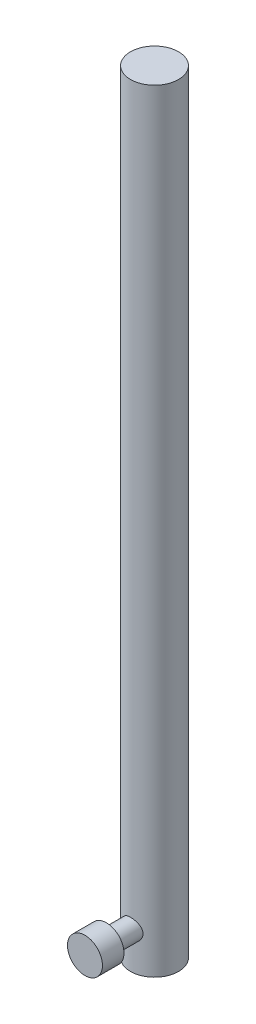
ISO-10303-21;
HEADER;
FILE_DESCRIPTION(('STEP AP214'),'2;1');
FILE_NAME('part.step','',(''),(''),'','','');
FILE_SCHEMA(('AUTOMOTIVE_DESIGN { 1 0 10303 214 1 1 1 1 }'));
ENDSEC;
DATA;
#1=APPLICATION_CONTEXT('core data for automotive mechanical design processes');
#2=APPLICATION_PROTOCOL_DEFINITION('international standard','automotive_design',2000,#1);
#3=PRODUCT_CONTEXT('',#1,'mechanical');
#4=PRODUCT('Part','Part','',(#3));
#5=PRODUCT_RELATED_PRODUCT_CATEGORY('part','',(#4));
#6=PRODUCT_DEFINITION_FORMATION('','',#4);
#7=PRODUCT_DEFINITION_CONTEXT('part definition',#1,'design');
#8=PRODUCT_DEFINITION('design','',#6,#7);
#9=PRODUCT_DEFINITION_SHAPE('','',#8);
#10=(LENGTH_UNIT() NAMED_UNIT(*) SI_UNIT(.MILLI.,.METRE.));
#11=(NAMED_UNIT(*) PLANE_ANGLE_UNIT() SI_UNIT($,.RADIAN.));
#12=(NAMED_UNIT(*) SI_UNIT($,.STERADIAN.) SOLID_ANGLE_UNIT());
#13=UNCERTAINTY_MEASURE_WITH_UNIT(LENGTH_MEASURE(1.E-05),#10,'distance_accuracy_value','');
#14=(GEOMETRIC_REPRESENTATION_CONTEXT(3) GLOBAL_UNCERTAINTY_ASSIGNED_CONTEXT((#13)) GLOBAL_UNIT_ASSIGNED_CONTEXT((#10,
#11,#12)) REPRESENTATION_CONTEXT('',''));
#15=CARTESIAN_POINT('',(0.,0.,0.));
#16=DIRECTION('',(0.,0.,1.));
#17=DIRECTION('',(1.,0.,0.));
#18=AXIS2_PLACEMENT_3D('',#15,#16,#17);
#19=CARTESIAN_POINT('',(0.,102.108,0.));
#20=DIRECTION('',(0.,-1.,0.));
#21=DIRECTION('',(0.,0.,-1.));
#22=AXIS2_PLACEMENT_3D('',#19,#20,#21);
#23=CYLINDRICAL_SURFACE('',#22,3.175);
#24=CARTESIAN_POINT('',(0.,0.,0.));
#25=DIRECTION('',(0.,1.,0.));
#26=DIRECTION('',(0.,0.,1.));
#27=AXIS2_PLACEMENT_3D('',#24,#25,#26);
#28=CIRCLE('',#27,3.175);
#29=CARTESIAN_POINT('',(0.,0.,3.175));
#30=VERTEX_POINT('',#29);
#31=EDGE_CURVE('E129',#30,#30,#28,.T.);
#32=ORIENTED_EDGE('',*,*,#31,.T.);
#33=EDGE_LOOP('',(#32));
#34=FACE_BOUND('',#33,.T.);
#35=CARTESIAN_POINT('',(0.,102.108,0.));
#36=DIRECTION('',(0.,1.,0.));
#37=DIRECTION('',(0.,0.,1.));
#38=AXIS2_PLACEMENT_3D('',#35,#36,#37);
#39=CIRCLE('',#38,3.175);
#40=CARTESIAN_POINT('',(0.,102.108,3.175));
#41=VERTEX_POINT('',#40);
#42=EDGE_CURVE('E68',#41,#41,#39,.T.);
#43=ORIENTED_EDGE('',*,*,#42,.F.);
#44=EDGE_LOOP('',(#43));
#45=FACE_BOUND('',#44,.T.);
#46=CARTESIAN_POINT('',(-1.35382,4.85382,2.87189770145108));
#47=CARTESIAN_POINT('',(-1.35381142228416,4.78178527879643,2.87190615339939));
#48=CARTESIAN_POINT('',(-1.34803428071228,4.70964023374533,2.87464762889286));
#49=CARTESIAN_POINT('',(-1.32515391894357,4.56744275120653,2.88526250822312));
#50=CARTESIAN_POINT('',(-1.30802062166884,4.49739638846042,2.89314953932647));
#51=CARTESIAN_POINT('',(-1.26322683379733,4.36171488687498,2.91298399106182));
#52=CARTESIAN_POINT('',(-1.2356106359559,4.29606253668086,2.9249143054327));
#53=CARTESIAN_POINT('',(-1.17076538079496,4.17034064718567,2.95146676418575));
#54=CARTESIAN_POINT('',(-1.13353828155274,4.11026997408761,2.96608836008562));
#55=CARTESIAN_POINT('',(-1.04793233597021,3.99346307381684,2.99744183012029));
#56=CARTESIAN_POINT('',(-0.999023918536112,3.93713454775226,3.01424738115443));
#57=CARTESIAN_POINT('',(-0.892554561058333,3.83317604635798,3.04747109252372));
#58=CARTESIAN_POINT('',(-0.834990208168869,3.78554951851573,3.06388909709044));
#59=CARTESIAN_POINT('',(-0.709607104496236,3.69823238165623,3.09539064187731));
#60=CARTESIAN_POINT('',(-0.641439437997789,3.65900517456155,3.11037861682877));
#61=CARTESIAN_POINT('',(-0.498717487402645,3.59275279200618,3.13642394106909));
#62=CARTESIAN_POINT('',(-0.424166184700303,3.56572195697194,3.14748311296206));
#63=CARTESIAN_POINT('',(-0.275078251523646,3.52612178625564,3.16390141625311));
#64=CARTESIAN_POINT('',(-0.200759771238017,3.51284812918421,3.16953696879562));
#65=CARTESIAN_POINT('',(-0.0507511927751991,3.49885852418454,3.17548015037632));
#66=CARTESIAN_POINT('',(0.0249383073634244,3.49813722696234,3.17579004898611));
#67=CARTESIAN_POINT('',(0.170400950739695,3.50891408338624,3.1712064249578));
#68=CARTESIAN_POINT('',(0.2402439156591,3.51963702663295,3.16664299981304));
#69=CARTESIAN_POINT('',(0.377028469796356,3.55166286405115,3.15328380378995));
#70=CARTESIAN_POINT('',(0.443969844286547,3.57296653978473,3.14448772026129));
#71=CARTESIAN_POINT('',(0.574286941395332,3.62579548386549,3.12333919617656));
#72=CARTESIAN_POINT('',(0.63759243955905,3.65747215504802,3.11093440262354));
#73=CARTESIAN_POINT('',(0.758155801903625,3.72999517484343,3.08377195448261));
#74=CARTESIAN_POINT('',(0.815411488341505,3.77084480901143,3.06901345739971));
#75=CARTESIAN_POINT('',(0.926713191008751,3.86403320631901,3.0373372090291));
#76=CARTESIAN_POINT('',(0.980216009783288,3.9169947842494,3.02034048031172));
#77=CARTESIAN_POINT('',(1.07782230972426,4.031158743125,2.98690333718196));
#78=CARTESIAN_POINT('',(1.1219218143327,4.09236459269964,2.97046316059186));
#79=CARTESIAN_POINT('',(1.20095869075221,4.22403583440652,2.93942082594528));
#80=CARTESIAN_POINT('',(1.23551166605267,4.29475422380019,2.92490550812828));
#81=CARTESIAN_POINT('',(1.29199390363088,4.44178846862235,2.9004026893379));
#82=CARTESIAN_POINT('',(1.31393268755954,4.51810005291392,2.89041177439368));
#83=CARTESIAN_POINT('',(1.34314669310234,4.66870236542284,2.87694724510349));
#84=CARTESIAN_POINT('',(1.35130594809818,4.74278588776625,2.87308179525616));
#85=CARTESIAN_POINT('',(1.35533612289285,4.89134851490668,2.87118392780632));
#86=CARTESIAN_POINT('',(1.35121164013541,4.96582746129246,2.87314932788618));
#87=CARTESIAN_POINT('',(1.33159911809945,5.10768898727275,2.88228534916434));
#88=CARTESIAN_POINT('',(1.31690812072575,5.17520838009434,2.88909051862509));
#89=CARTESIAN_POINT('',(1.27764920814589,5.30676141917168,2.90666415792056));
#90=CARTESIAN_POINT('',(1.25307891063266,5.37079422043455,2.91743358364812));
#91=CARTESIAN_POINT('',(1.19358377177312,5.49665823674378,2.94228852401562));
#92=CARTESIAN_POINT('',(1.15825678149054,5.55827419688496,2.95649739435406));
#93=CARTESIAN_POINT('',(1.07864482145473,5.67500848478275,2.98646240838629));
#94=CARTESIAN_POINT('',(1.03435584882254,5.73012389158669,3.00221924185569));
#95=CARTESIAN_POINT('',(0.933590517029275,5.83723056392191,3.03513989572716));
#96=CARTESIAN_POINT('',(0.876393490796542,5.88854520777457,3.05230814720174));
#97=CARTESIAN_POINT('',(0.753811575931214,5.98097957405124,3.08486803080184));
#98=CARTESIAN_POINT('',(0.688425910298954,6.02209832790776,3.10025949406562));
#99=CARTESIAN_POINT('',(0.550705508113694,6.09300252967605,3.12766579184468));
#100=CARTESIAN_POINT('',(0.478341075112678,6.12273660537439,3.139665258107));
#101=CARTESIAN_POINT('',(0.328991305032905,6.16938183504049,3.15880395652874));
#102=CARTESIAN_POINT('',(0.252008895355335,6.18630102175683,3.16594623303003));
#103=CARTESIAN_POINT('',(0.101640912080045,6.2057901962641,3.17420070128252));
#104=CARTESIAN_POINT('',(0.0283999974199206,6.20931281136644,3.17571305397883));
#105=CARTESIAN_POINT('',(-0.117609949959003,6.20449716758914,3.17366026831081));
#106=CARTESIAN_POINT('',(-0.190379069841523,6.19616116615871,3.17009609633196));
#107=CARTESIAN_POINT('',(-0.330487253617228,6.16854867177737,3.15850605798547));
#108=CARTESIAN_POINT('',(-0.397927521000378,6.14970517265205,3.15065701630327));
#109=CARTESIAN_POINT('',(-0.528655413847157,6.10209646440815,3.13137641775701));
#110=CARTESIAN_POINT('',(-0.591942267767414,6.07332941805322,3.11994419754243));
#111=CARTESIAN_POINT('',(-0.715748776417546,6.00523203041639,3.09394768115489));
#112=CARTESIAN_POINT('',(-0.77601096265985,5.96548011010551,3.07926441038834));
#113=CARTESIAN_POINT('',(-0.889270116409888,5.87714309838841,3.04848712934404));
#114=CARTESIAN_POINT('',(-0.942264225815633,5.82855454943299,3.03239256814504));
#115=CARTESIAN_POINT('',(-1.04344612161364,5.71981767926984,2.99914688637426));
#116=CARTESIAN_POINT('',(-1.09101571869312,5.65908988970699,2.98200286585594));
#117=CARTESIAN_POINT('',(-1.17539449072067,5.53000180718138,2.94976624578277));
#118=CARTESIAN_POINT('',(-1.21219745446673,5.46163713985127,2.9346748330396));
#119=CARTESIAN_POINT('',(-1.27370318114949,5.31913492481194,2.90850906005651));
#120=CARTESIAN_POINT('',(-1.2984360009552,5.2450122552546,2.89742473947121));
#121=CARTESIAN_POINT('',(-1.33476329449195,5.09316408041629,2.88087616561345));
#122=CARTESIAN_POINT('',(-1.34640183721237,5.01545158179109,2.87539306711189));
#123=CARTESIAN_POINT('',(-1.35296286010547,4.90955275058417,2.87230040022709));
#124=CARTESIAN_POINT('',(-1.35382331924238,4.88169463517761,2.87189443087584));
#125=CARTESIAN_POINT('',(-1.35382,4.85382,2.87189770145108));
#126=B_SPLINE_CURVE_WITH_KNOTS('',3,(#46,#47,#48,#49,#50,#51,#52,#53,#54,#55,#56,#57,#58,#59,
#60,#61,#62,#63,#64,#65,#66,#67,#68,#69,#70,#71,#72,#73,#74,#75,#76,#77,#78,#79,#80,#81,#82,#83,
#84,#85,#86,#87,#88,#89,#90,#91,#92,#93,#94,#95,#96,#97,#98,#99,#100,#101,#102,#103,#104,#105,
#106,#107,#108,#109,#110,#111,#112,#113,#114,#115,#116,#117,#118,#119,#120,#121,#122,#123,#124,
#125),.UNSPECIFIED.,.T.,.F.,(4,2,2,2,2,2,2,2,2,2,2,2,2,2,2,2,2,2,2,2,2,2,2,2,2,2,2,2,2,2,2,2,2,
2,2,2,2,2,2,4),(0.,0.216021326841516,0.432617090361898,0.648307692110528,0.863954384758075,
1.09236273355408,1.3208613760451,1.5598258793317,1.79867937980498,2.02458878143529,
2.25040190751089,2.4618352401061,2.67328419287318,2.88796830237239,3.10272943003436,
3.33323810249158,3.56384406204454,3.80270332763691,4.04138205605385,4.26406813073999,
4.48667087101723,4.69403866331436,4.90145649056434,5.11785207578275,5.33434452851275,
5.56946069032969,5.80459917866288,6.04078654042894,6.27682573021964,6.49572743397313,
6.71458747238102,6.92503219186545,7.13551589381974,7.35558996104085,7.57575032366364,
7.81171639106655,8.04781831855567,8.28332927029353,8.51804521290998,8.60163706383523),.UNSPECIFIED.);
#127=CARTESIAN_POINT('',(-1.35382,4.85382,2.87189770145108));
#128=VERTEX_POINT('',#127);
#129=EDGE_CURVE('E11',#128,#128,#126,.T.);
#130=ORIENTED_EDGE('',*,*,#129,.F.);
#131=EDGE_LOOP('',(#130));
#132=FACE_BOUND('',#131,.T.);
#133=ADVANCED_FACE('F31',(#34,#45,#132),#23,.T.);
#134=CARTESIAN_POINT('',(0.,6.35,0.));
#135=DIRECTION('',(0.,-1.,0.));
#136=DIRECTION('',(0.,0.,-1.));
#137=AXIS2_PLACEMENT_3D('',#134,#135,#136);
#138=CYLINDRICAL_SURFACE('',#137,1.);
#139=CARTESIAN_POINT('',(0.,0.,0.));
#140=DIRECTION('',(0.,-1.,0.));
#141=DIRECTION('',(0.,0.,-1.));
#142=AXIS2_PLACEMENT_3D('',#139,#140,#141);
#143=CIRCLE('',#142,1.);
#144=CARTESIAN_POINT('',(0.,0.,-1.));
#145=VERTEX_POINT('',#144);
#146=EDGE_CURVE('E137',#145,#145,#143,.T.);
#147=ORIENTED_EDGE('',*,*,#146,.T.);
#148=EDGE_LOOP('',(#147));
#149=FACE_BOUND('',#148,.T.);
#150=CARTESIAN_POINT('',(0.,6.35,0.));
#151=DIRECTION('',(0.,-1.,0.));
#152=DIRECTION('',(0.,0.,-1.));
#153=AXIS2_PLACEMENT_3D('',#150,#151,#152);
#154=CIRCLE('',#153,1.);
#155=CARTESIAN_POINT('',(0.,6.35,-1.));
#156=VERTEX_POINT('',#155);
#157=EDGE_CURVE('E83',#156,#156,#154,.T.);
#158=ORIENTED_EDGE('',*,*,#157,.F.);
#159=EDGE_LOOP('',(#158));
#160=FACE_BOUND('',#159,.T.);
#161=DIRECTION('',(0.,-1.,0.));
#162=VECTOR('',#161,1.);
#163=CARTESIAN_POINT('',(-1.,6.35,0.));
#164=LINE('',#163,#162);
#165=CARTESIAN_POINT('',(-1.,3.94122557069419,0.));
#166=VERTEX_POINT('',#165);
#167=CARTESIAN_POINT('',(-1.,5.76641442930581,0.));
#168=VERTEX_POINT('',#167);
#169=EDGE_CURVE('E35',#166,#168,#164,.F.);
#170=ORIENTED_EDGE('',*,*,#169,.F.);
#171=CARTESIAN_POINT('',(1.,3.94122557069419,0.));
#172=CARTESIAN_POINT('',(1.00000511214021,3.94124004161845,0.0237213055983392));
#173=CARTESIAN_POINT('',(0.999155544112792,3.94029979878123,0.0474219644977218));
#174=CARTESIAN_POINT('',(0.995801046742013,3.93664018336344,0.0945224296701222));
#175=CARTESIAN_POINT('',(0.993299350301345,3.93392428550732,0.11792273269981));
#176=CARTESIAN_POINT('',(0.983478507098933,3.92339506460693,0.186815033275608));
#177=CARTESIAN_POINT('',(0.97384044649221,3.9131932985857,0.231632112740939));
#178=CARTESIAN_POINT('',(0.949167837633535,3.88831092168676,0.317948719260517));
#179=CARTESIAN_POINT('',(0.934172273042721,3.87366277758343,0.359469630201528));
#180=CARTESIAN_POINT('',(0.899334617524785,3.84160003231702,0.439437435692129));
#181=CARTESIAN_POINT('',(0.879475196479821,3.82417561852924,0.477872670872861));
#182=CARTESIAN_POINT('',(0.830915391435768,3.78443839429363,0.558774739094301));
#183=CARTESIAN_POINT('',(0.801241820805782,3.76184345188414,0.600518297634789));
#184=CARTESIAN_POINT('',(0.735859334824777,3.71675316330911,0.679059772196196));
#185=CARTESIAN_POINT('',(0.700147042978353,3.6942578801283,0.715854900569169));
#186=CARTESIAN_POINT('',(0.615320947234365,3.64675307689138,0.79067935793775));
#187=CARTESIAN_POINT('',(0.564952084223723,3.62211184099887,0.827543565943061));
#188=CARTESIAN_POINT('',(0.456558146943862,3.57797331339796,0.891908946825326));
#189=CARTESIAN_POINT('',(0.398549553943174,3.55846521208489,0.919429831406381));
#190=CARTESIAN_POINT('',(0.294499575836977,3.53166937046956,0.956747831357076));
#191=CARTESIAN_POINT('',(0.249956651014413,3.52247495220736,0.969377133338135));
#192=CARTESIAN_POINT('',(0.158885436424527,3.50856972371849,0.988388980714752));
#193=CARTESIAN_POINT('',(0.11235891586727,3.50385500189411,0.994776976055435));
#194=CARTESIAN_POINT('',(0.0185126254039587,3.49930962881772,1.00093659392903));
#195=CARTESIAN_POINT('',(-0.0288088061188651,3.49949094954801,1.00069199820154));
#196=CARTESIAN_POINT('',(-0.122675065690299,3.50474989258142,0.993562909534897));
#197=CARTESIAN_POINT('',(-0.169219700282237,3.50982871660004,0.986676786943711));
#198=CARTESIAN_POINT('',(-0.258756708563003,3.52420838049952,0.966996213147564));
#199=CARTESIAN_POINT('',(-0.301814842541836,3.53337083376167,0.954395200872019));
#200=CARTESIAN_POINT('',(-0.385072130278742,3.55520432221905,0.923951489045881));
#201=CARTESIAN_POINT('',(-0.42527065794476,3.56787612280944,0.90610764597239));
#202=CARTESIAN_POINT('',(-0.506463068288252,3.59748010295669,0.863608469622721));
#203=CARTESIAN_POINT('',(-0.547061675800682,3.61472692567156,0.83842109399366));
#204=CARTESIAN_POINT('',(-0.623648454876973,3.65144790651269,0.783133035715469));
#205=CARTESIAN_POINT('',(-0.659632681623747,3.67092394382275,0.753028198477479));
#206=CARTESIAN_POINT('',(-0.733249924405706,3.71480986026456,0.68222780387262));
#207=CARTESIAN_POINT('',(-0.769861263060921,3.73944660983649,0.640609572035453));
#208=CARTESIAN_POINT('',(-0.835928617723872,3.78811237709663,0.551631537112706));
#209=CARTESIAN_POINT('',(-0.865379131910895,3.8121409148636,0.5042673609059));
#210=CARTESIAN_POINT('',(-0.911177345004969,3.85216614016381,0.414418611679372));
#211=CARTESIAN_POINT('',(-0.928975703326979,3.86879517714467,0.372958409433787));
#212=CARTESIAN_POINT('',(-0.959042074630633,3.89804518301748,0.286881700122387));
#213=CARTESIAN_POINT('',(-0.971335707375562,3.91068463707776,0.242280956972089));
#214=CARTESIAN_POINT('',(-0.986880187527612,3.92700445754668,0.164659726315203));
#215=CARTESIAN_POINT('',(-0.991749102039944,3.93224448433547,0.132293991600466));
#216=CARTESIAN_POINT('',(-0.998332121520634,3.93939691475009,0.066645608345321));
#217=CARTESIAN_POINT('',(-1.00002261102266,3.9412844035869,0.0333579465486954));
#218=CARTESIAN_POINT('',(-1.,3.94122557069419,0.));
#219=B_SPLINE_CURVE_WITH_KNOTS('',3,(#171,#172,#173,#174,#175,#176,#177,#178,#179,#180,#181,
#182,#183,#184,#185,#186,#187,#188,#189,#190,#191,#192,#193,#194,#195,#196,#197,#198,#199,#200,
#201,#202,#203,#204,#205,#206,#207,#208,#209,#210,#211,#212,#213,#214,#215,#216,#217,#218),
.UNSPECIFIED.,.F.,.F.,(4,2,2,2,2,2,2,2,2,2,2,2,2,2,2,2,2,2,2,2,2,2,2,4),(0.,0.0710935143434935,
0.142048322712988,0.28209173184269,0.421136207963379,0.5606835027299,0.728043878437994,
0.895498143481713,1.09569084033054,1.29545852520792,1.43646935924249,1.5773569514598,
1.71858907829649,1.85985586851672,1.99666175623454,2.13349750509996,2.28532319414256,
2.43727782516194,2.61855370668411,2.7999684294849,2.94376951277038,3.0868941864878,
3.18602245425892,3.28588437117136),.UNSPECIFIED.);
#220=CARTESIAN_POINT('',(1.,3.94122557069419,0.));
#221=VERTEX_POINT('',#220);
#222=EDGE_CURVE('E55',#221,#166,#219,.T.);
#223=ORIENTED_EDGE('',*,*,#222,.F.);
#224=DIRECTION('',(0.,-1.,0.));
#225=VECTOR('',#224,1.);
#226=CARTESIAN_POINT('',(1.,6.35,0.));
#227=LINE('',#226,#225);
#228=CARTESIAN_POINT('',(1.,5.76641442930581,0.));
#229=VERTEX_POINT('',#228);
#230=EDGE_CURVE('E58',#229,#221,#227,.T.);
#231=ORIENTED_EDGE('',*,*,#230,.F.);
#232=CARTESIAN_POINT('',(-1.,5.76641442930581,0.));
#233=CARTESIAN_POINT('',(-1.00000511214021,5.76639995838155,0.0237213055983392));
#234=CARTESIAN_POINT('',(-0.999155544112792,5.76734020121877,0.0474219644977219));
#235=CARTESIAN_POINT('',(-0.995801046742013,5.77099981663656,0.0945224296701222));
#236=CARTESIAN_POINT('',(-0.993299350301345,5.77371571449268,0.11792273269981));
#237=CARTESIAN_POINT('',(-0.983478507098933,5.78424493539307,0.186815033275608));
#238=CARTESIAN_POINT('',(-0.97384044649221,5.7944467014143,0.231632112740939));
#239=CARTESIAN_POINT('',(-0.949167837633535,5.81932907831324,0.317948719260517));
#240=CARTESIAN_POINT('',(-0.934172273042721,5.83397722241657,0.359469630201528));
#241=CARTESIAN_POINT('',(-0.899334617524785,5.86603996768298,0.439437435692129));
#242=CARTESIAN_POINT('',(-0.879475196479822,5.88346438147076,0.477872670872861));
#243=CARTESIAN_POINT('',(-0.830915391435768,5.92320160570637,0.558774739094301));
#244=CARTESIAN_POINT('',(-0.801241820805782,5.94579654811586,0.600518297634788));
#245=CARTESIAN_POINT('',(-0.735859334824777,5.99088683669089,0.679059772196195));
#246=CARTESIAN_POINT('',(-0.700147042978353,6.0133821198717,0.715854900569169));
#247=CARTESIAN_POINT('',(-0.615320947234365,6.06088692310862,0.79067935793775));
#248=CARTESIAN_POINT('',(-0.564952084223722,6.08552815900113,0.827543565943061));
#249=CARTESIAN_POINT('',(-0.456558146943862,6.12966668660204,0.891908946825326));
#250=CARTESIAN_POINT('',(-0.398549553943174,6.14917478791511,0.919429831406381));
#251=CARTESIAN_POINT('',(-0.294499575836978,6.17597062953044,0.956747831357076));
#252=CARTESIAN_POINT('',(-0.249956651014414,6.18516504779264,0.969377133338135));
#253=CARTESIAN_POINT('',(-0.158885436424527,6.19907027628151,0.988388980714752));
#254=CARTESIAN_POINT('',(-0.11235891586727,6.20378499810589,0.994776976055435));
#255=CARTESIAN_POINT('',(-0.0185126254039593,6.20833037118228,1.00093659392903));
#256=CARTESIAN_POINT('',(0.0288088061188645,6.20814905045199,1.00069199820154));
#257=CARTESIAN_POINT('',(0.122675065690298,6.20289010741858,0.993562909534897));
#258=CARTESIAN_POINT('',(0.169219700282236,6.19781128339996,0.986676786943711));
#259=CARTESIAN_POINT('',(0.258756708563002,6.18343161950048,0.966996213147564));
#260=CARTESIAN_POINT('',(0.301814842541836,6.17426916623833,0.95439520087202));
#261=CARTESIAN_POINT('',(0.385072130278742,6.15243567778095,0.923951489045882));
#262=CARTESIAN_POINT('',(0.42527065794476,6.13976387719056,0.90610764597239));
#263=CARTESIAN_POINT('',(0.506463068288252,6.11015989704331,0.863608469622722));
#264=CARTESIAN_POINT('',(0.547061675800682,6.09291307432844,0.838421093993661));
#265=CARTESIAN_POINT('',(0.623648454876972,6.05619209348732,0.783133035715469));
#266=CARTESIAN_POINT('',(0.659632681623747,6.03671605617725,0.753028198477479));
#267=CARTESIAN_POINT('',(0.733249924405706,5.99283013973544,0.68222780387262));
#268=CARTESIAN_POINT('',(0.76986126306092,5.96819339016351,0.640609572035454));
#269=CARTESIAN_POINT('',(0.835928617723871,5.91952762290337,0.551631537112707));
#270=CARTESIAN_POINT('',(0.865379131910894,5.8954990851364,0.5042673609059));
#271=CARTESIAN_POINT('',(0.911177345004969,5.85547385983619,0.414418611679373));
#272=CARTESIAN_POINT('',(0.928975703326979,5.83884482285533,0.372958409433788));
#273=CARTESIAN_POINT('',(0.959042074630632,5.80959481698252,0.286881700122388));
#274=CARTESIAN_POINT('',(0.971335707375562,5.79695536292225,0.24228095697209));
#275=CARTESIAN_POINT('',(0.986880187527612,5.78063554245332,0.164659726315204));
#276=CARTESIAN_POINT('',(0.991749102039944,5.77539551566453,0.132293991600467));
#277=CARTESIAN_POINT('',(0.998332121520634,5.76824308524991,0.0666456083453217));
#278=CARTESIAN_POINT('',(1.00002261102266,5.7663555964131,0.0333579465486958));
#279=CARTESIAN_POINT('',(1.,5.76641442930581,0.));
#280=B_SPLINE_CURVE_WITH_KNOTS('',3,(#232,#233,#234,#235,#236,#237,#238,#239,#240,#241,#242,
#243,#244,#245,#246,#247,#248,#249,#250,#251,#252,#253,#254,#255,#256,#257,#258,#259,#260,#261,
#262,#263,#264,#265,#266,#267,#268,#269,#270,#271,#272,#273,#274,#275,#276,#277,#278,#279),
.UNSPECIFIED.,.F.,.F.,(4,2,2,2,2,2,2,2,2,2,2,2,2,2,2,2,2,2,2,2,2,2,2,4),(0.,0.0710935143434936,
0.142048322712988,0.28209173184269,0.421136207963378,0.560683502729899,0.728043878437994,
0.895498143481714,1.09569084033054,1.29545852520792,1.43646935924249,1.5773569514598,
1.71858907829649,1.85985586851672,1.99666175623454,2.13349750509996,2.28532319414256,
2.43727782516194,2.61855370668411,2.7999684294849,2.94376951277038,3.08689418648779,
3.18602245425892,3.28588437117136),.UNSPECIFIED.);
#281=EDGE_CURVE('E51',#168,#229,#280,.T.);
#282=ORIENTED_EDGE('',*,*,#281,.F.);
#283=EDGE_LOOP('',(#170,#223,#231,#282));
#284=FACE_BOUND('',#283,.T.);
#285=ADVANCED_FACE('F57',(#149,#160,#284),#138,.F.);
#286=CARTESIAN_POINT('',(0.,102.108,0.));
#287=DIRECTION('',(0.,1.,0.));
#288=DIRECTION('',(0.,0.,1.));
#289=AXIS2_PLACEMENT_3D('',#286,#287,#288);
#290=PLANE('',#289);
#291=ORIENTED_EDGE('',*,*,#42,.T.);
#292=EDGE_LOOP('',(#291));
#293=FACE_BOUND('',#292,.T.);
#294=ADVANCED_FACE('F108',(#293),#290,.T.);
#295=CARTESIAN_POINT('',(0.,0.,0.));
#296=DIRECTION('',(0.,1.,0.));
#297=DIRECTION('',(0.,0.,1.));
#298=AXIS2_PLACEMENT_3D('',#295,#296,#297);
#299=PLANE('',#298);
#300=ORIENTED_EDGE('',*,*,#146,.F.);
#301=EDGE_LOOP('',(#300));
#302=FACE_BOUND('',#301,.T.);
#303=ORIENTED_EDGE('',*,*,#31,.F.);
#304=EDGE_LOOP('',(#303));
#305=FACE_BOUND('',#304,.T.);
#306=ADVANCED_FACE('F112',(#302,#305),#299,.F.);
#307=CARTESIAN_POINT('',(0.,6.35,0.));
#308=DIRECTION('',(0.,-1.,0.));
#309=DIRECTION('',(0.,0.,-1.));
#310=AXIS2_PLACEMENT_3D('',#307,#308,#309);
#311=PLANE('',#310);
#312=ORIENTED_EDGE('',*,*,#157,.T.);
#313=EDGE_LOOP('',(#312));
#314=FACE_BOUND('',#313,.T.);
#315=ADVANCED_FACE('F94',(#314),#311,.T.);
#316=CARTESIAN_POINT('',(0.,4.85382,0.));
#317=DIRECTION('',(0.,0.,1.));
#318=DIRECTION('',(1.,0.,0.));
#319=AXIS2_PLACEMENT_3D('',#316,#317,#318);
#320=PLANE('',#319);
#321=CARTESIAN_POINT('',(0.,4.85382,0.));
#322=DIRECTION('',(0.,0.,1.));
#323=DIRECTION('',(1.,0.,0.));
#324=AXIS2_PLACEMENT_3D('',#321,#322,#323);
#325=CIRCLE('',#324,1.35382);
#326=EDGE_CURVE('E65',#166,#221,#325,.T.);
#327=ORIENTED_EDGE('',*,*,#326,.F.);
#328=ORIENTED_EDGE('',*,*,#169,.T.);
#329=EDGE_CURVE('E67',#229,#168,#325,.T.);
#330=ORIENTED_EDGE('',*,*,#329,.F.);
#331=ORIENTED_EDGE('',*,*,#230,.T.);
#332=EDGE_LOOP('',(#327,#328,#330,#331));
#333=FACE_BOUND('',#332,.T.);
#334=ADVANCED_FACE('F64',(#333),#320,.F.);
#335=CARTESIAN_POINT('',(0.,4.85382,6.35));
#336=DIRECTION('',(0.,0.,-1.));
#337=DIRECTION('',(-1.,0.,0.));
#338=AXIS2_PLACEMENT_3D('',#335,#336,#337);
#339=CYLINDRICAL_SURFACE('',#338,1.35382);
#340=ORIENTED_EDGE('',*,*,#329,.T.);
#341=ORIENTED_EDGE('',*,*,#281,.T.);
#342=EDGE_LOOP('',(#340,#341));
#343=FACE_BOUND('',#342,.T.);
#344=ADVANCED_FACE('F92',(#343),#339,.T.);
#345=ORIENTED_EDGE('',*,*,#326,.T.);
#346=ORIENTED_EDGE('',*,*,#222,.T.);
#347=EDGE_LOOP('',(#345,#346));
#348=FACE_BOUND('',#347,.T.);
#349=ADVANCED_FACE('F70',(#348),#339,.T.);
#350=CARTESIAN_POINT('',(0.,4.85382,6.35));
#351=DIRECTION('',(0.,0.,1.));
#352=DIRECTION('',(1.,0.,0.));
#353=AXIS2_PLACEMENT_3D('',#350,#351,#352);
#354=CIRCLE('',#353,1.35382);
#355=CARTESIAN_POINT('',(1.35382,4.85382,6.35));
#356=VERTEX_POINT('',#355);
#357=EDGE_CURVE('E73',#356,#356,#354,.T.);
#358=ORIENTED_EDGE('',*,*,#357,.F.);
#359=EDGE_LOOP('',(#358));
#360=FACE_BOUND('',#359,.T.);
#361=ORIENTED_EDGE('',*,*,#129,.T.);
#362=EDGE_LOOP('',(#361));
#363=FACE_BOUND('',#362,.T.);
#364=ADVANCED_FACE('F85',(#360,#363),#339,.T.);
#365=CARTESIAN_POINT('',(0.,4.85382,6.35));
#366=DIRECTION('',(0.,0.,1.));
#367=DIRECTION('',(1.,0.,0.));
#368=AXIS2_PLACEMENT_3D('',#365,#366,#367);
#369=PLANE('',#368);
#370=CARTESIAN_POINT('',(0.,4.85382,6.35));
#371=DIRECTION('',(0.,0.,1.));
#372=DIRECTION('',(1.,0.,0.));
#373=AXIS2_PLACEMENT_3D('',#370,#371,#372);
#374=CIRCLE('',#373,2.3114);
#375=CARTESIAN_POINT('',(2.3114,4.85382,6.35));
#376=VERTEX_POINT('',#375);
#377=EDGE_CURVE('E75',#376,#376,#374,.T.);
#378=ORIENTED_EDGE('',*,*,#377,.F.);
#379=EDGE_LOOP('',(#378));
#380=FACE_BOUND('',#379,.T.);
#381=ORIENTED_EDGE('',*,*,#357,.T.);
#382=EDGE_LOOP('',(#381));
#383=FACE_BOUND('',#382,.T.);
#384=ADVANCED_FACE('F90',(#380,#383),#369,.F.);
#385=CARTESIAN_POINT('',(0.,4.85382,9.1948));
#386=DIRECTION('',(0.,0.,-1.));
#387=DIRECTION('',(-1.,0.,0.));
#388=AXIS2_PLACEMENT_3D('',#385,#386,#387);
#389=CYLINDRICAL_SURFACE('',#388,2.3114);
#390=CARTESIAN_POINT('',(0.,4.85382,9.1948));
#391=DIRECTION('',(0.,0.,1.));
#392=DIRECTION('',(1.,0.,0.));
#393=AXIS2_PLACEMENT_3D('',#390,#391,#392);
#394=CIRCLE('',#393,2.3114);
#395=CARTESIAN_POINT('',(2.3114,4.85382,9.1948));
#396=VERTEX_POINT('',#395);
#397=EDGE_CURVE('E71',#396,#396,#394,.T.);
#398=ORIENTED_EDGE('',*,*,#397,.F.);
#399=EDGE_LOOP('',(#398));
#400=FACE_BOUND('',#399,.T.);
#401=ORIENTED_EDGE('',*,*,#377,.T.);
#402=EDGE_LOOP('',(#401));
#403=FACE_BOUND('',#402,.T.);
#404=ADVANCED_FACE('F144',(#400,#403),#389,.T.);
#405=CARTESIAN_POINT('',(0.,4.85382,9.1948));
#406=DIRECTION('',(0.,0.,1.));
#407=DIRECTION('',(1.,0.,0.));
#408=AXIS2_PLACEMENT_3D('',#405,#406,#407);
#409=PLANE('',#408);
#410=ORIENTED_EDGE('',*,*,#397,.T.);
#411=EDGE_LOOP('',(#410));
#412=FACE_BOUND('',#411,.T.);
#413=ADVANCED_FACE('F150',(#412),#409,.T.);
#414=CLOSED_SHELL('',(#133,#285,#294,#306,#315,#334,#344,#349,#364,#384,#404,#413));
#415=MANIFOLD_SOLID_BREP('B2',#414);
#416=ADVANCED_BREP_SHAPE_REPRESENTATION('',(#18,#415),#14);
#417=SHAPE_DEFINITION_REPRESENTATION(#9,#416);
ENDSEC;
END-ISO-10303-21;
